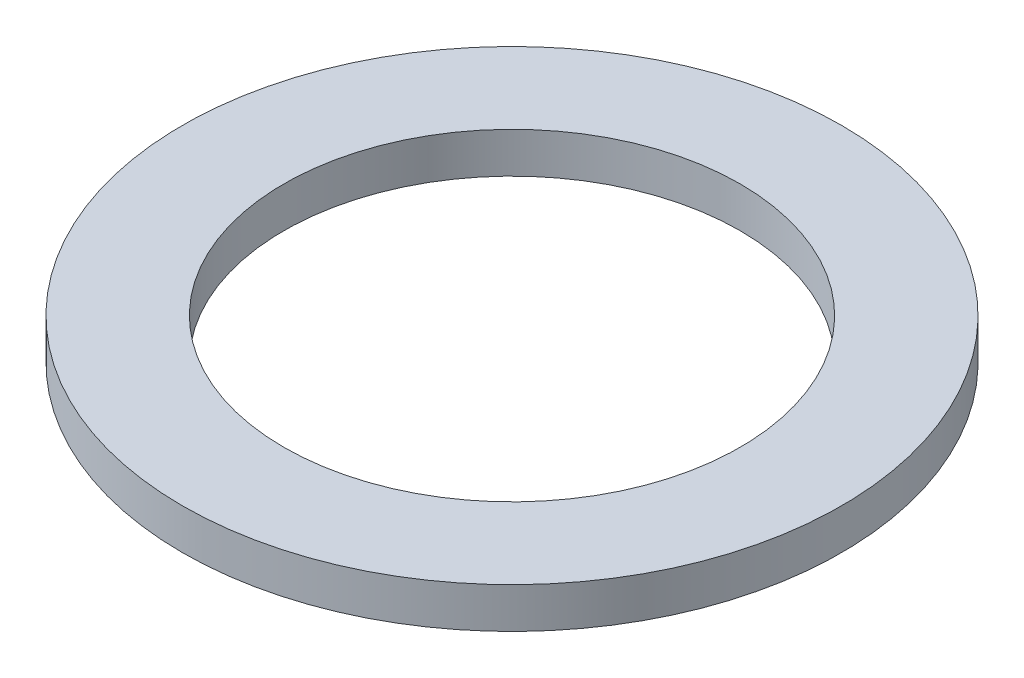
ISO-10303-21;
HEADER;
FILE_DESCRIPTION(('STEP AP214'),'2;1');
FILE_NAME('part.step','',(''),(''),'','','');
FILE_SCHEMA(('AUTOMOTIVE_DESIGN { 1 0 10303 214 1 1 1 1 }'));
ENDSEC;
DATA;
#1=APPLICATION_CONTEXT('core data for automotive mechanical design processes');
#2=APPLICATION_PROTOCOL_DEFINITION('international standard','automotive_design',2000,#1);
#3=PRODUCT_CONTEXT('',#1,'mechanical');
#4=PRODUCT('Part','Part','',(#3));
#5=PRODUCT_RELATED_PRODUCT_CATEGORY('part','',(#4));
#6=PRODUCT_DEFINITION_FORMATION('','',#4);
#7=PRODUCT_DEFINITION_CONTEXT('part definition',#1,'design');
#8=PRODUCT_DEFINITION('design','',#6,#7);
#9=PRODUCT_DEFINITION_SHAPE('','',#8);
#10=(LENGTH_UNIT() NAMED_UNIT(*) SI_UNIT(.MILLI.,.METRE.));
#11=(NAMED_UNIT(*) PLANE_ANGLE_UNIT() SI_UNIT($,.RADIAN.));
#12=(NAMED_UNIT(*) SI_UNIT($,.STERADIAN.) SOLID_ANGLE_UNIT());
#13=UNCERTAINTY_MEASURE_WITH_UNIT(LENGTH_MEASURE(1.E-05),#10,'distance_accuracy_value','');
#14=(GEOMETRIC_REPRESENTATION_CONTEXT(3) GLOBAL_UNCERTAINTY_ASSIGNED_CONTEXT((#13)) GLOBAL_UNIT_ASSIGNED_CONTEXT((#10,
#11,#12)) REPRESENTATION_CONTEXT('',''));
#15=CARTESIAN_POINT('',(0.,0.,0.));
#16=DIRECTION('',(0.,0.,1.));
#17=DIRECTION('',(1.,0.,0.));
#18=AXIS2_PLACEMENT_3D('',#15,#16,#17);
#19=CARTESIAN_POINT('',(0.,4.,0.));
#20=DIRECTION('',(0.,-1.,0.));
#21=DIRECTION('',(0.,0.,-1.));
#22=AXIS2_PLACEMENT_3D('',#19,#20,#21);
#23=CYLINDRICAL_SURFACE('',#22,32.5);
#24=CARTESIAN_POINT('',(0.,4.,0.));
#25=DIRECTION('',(0.,1.,0.));
#26=DIRECTION('',(0.,0.,1.));
#27=AXIS2_PLACEMENT_3D('',#24,#25,#26);
#28=CIRCLE('',#27,32.5);
#29=CARTESIAN_POINT('',(0.,4.,32.5));
#30=VERTEX_POINT('',#29);
#31=EDGE_CURVE('E10',#30,#30,#28,.T.);
#32=ORIENTED_EDGE('',*,*,#31,.F.);
#33=EDGE_LOOP('',(#32));
#34=FACE_BOUND('',#33,.T.);
#35=CARTESIAN_POINT('',(0.,0.,0.));
#36=DIRECTION('',(0.,1.,0.));
#37=DIRECTION('',(0.,0.,1.));
#38=AXIS2_PLACEMENT_3D('',#35,#36,#37);
#39=CIRCLE('',#38,32.5);
#40=CARTESIAN_POINT('',(0.,0.,32.5));
#41=VERTEX_POINT('',#40);
#42=EDGE_CURVE('E37',#41,#41,#39,.T.);
#43=ORIENTED_EDGE('',*,*,#42,.T.);
#44=EDGE_LOOP('',(#43));
#45=FACE_BOUND('',#44,.T.);
#46=ADVANCED_FACE('F40',(#34,#45),#23,.T.);
#47=CARTESIAN_POINT('',(0.,4.,0.));
#48=DIRECTION('',(0.,1.,0.));
#49=DIRECTION('',(0.,0.,1.));
#50=AXIS2_PLACEMENT_3D('',#47,#48,#49);
#51=PLANE('',#50);
#52=CARTESIAN_POINT('',(0.,4.,0.));
#53=DIRECTION('',(0.,1.,0.));
#54=DIRECTION('',(0.,0.,1.));
#55=AXIS2_PLACEMENT_3D('',#52,#53,#54);
#56=CIRCLE('',#55,22.5);
#57=CARTESIAN_POINT('',(0.,4.,22.5));
#58=VERTEX_POINT('',#57);
#59=EDGE_CURVE('E50',#58,#58,#56,.T.);
#60=ORIENTED_EDGE('',*,*,#59,.F.);
#61=EDGE_LOOP('',(#60));
#62=FACE_BOUND('',#61,.T.);
#63=ORIENTED_EDGE('',*,*,#31,.T.);
#64=EDGE_LOOP('',(#63));
#65=FACE_BOUND('',#64,.T.);
#66=ADVANCED_FACE('F59',(#62,#65),#51,.T.);
#67=CARTESIAN_POINT('',(0.,0.,0.));
#68=DIRECTION('',(0.,1.,0.));
#69=DIRECTION('',(0.,0.,1.));
#70=AXIS2_PLACEMENT_3D('',#67,#68,#69);
#71=PLANE('',#70);
#72=CARTESIAN_POINT('',(0.,0.,0.));
#73=DIRECTION('',(0.,1.,0.));
#74=DIRECTION('',(0.,0.,1.));
#75=AXIS2_PLACEMENT_3D('',#72,#73,#74);
#76=CIRCLE('',#75,22.5);
#77=CARTESIAN_POINT('',(0.,0.,22.5));
#78=VERTEX_POINT('',#77);
#79=EDGE_CURVE('E47',#78,#78,#76,.T.);
#80=ORIENTED_EDGE('',*,*,#79,.T.);
#81=EDGE_LOOP('',(#80));
#82=FACE_BOUND('',#81,.T.);
#83=ORIENTED_EDGE('',*,*,#42,.F.);
#84=EDGE_LOOP('',(#83));
#85=FACE_BOUND('',#84,.T.);
#86=ADVANCED_FACE('F58',(#82,#85),#71,.F.);
#87=CARTESIAN_POINT('',(0.,4.,0.));
#88=DIRECTION('',(0.,-1.,0.));
#89=DIRECTION('',(0.,0.,-1.));
#90=AXIS2_PLACEMENT_3D('',#87,#88,#89);
#91=CYLINDRICAL_SURFACE('',#90,22.5);
#92=ORIENTED_EDGE('',*,*,#59,.T.);
#93=EDGE_LOOP('',(#92));
#94=FACE_BOUND('',#93,.T.);
#95=ORIENTED_EDGE('',*,*,#79,.F.);
#96=EDGE_LOOP('',(#95));
#97=FACE_BOUND('',#96,.T.);
#98=ADVANCED_FACE('F54',(#94,#97),#91,.F.);
#99=CLOSED_SHELL('',(#46,#66,#86,#98));
#100=MANIFOLD_SOLID_BREP('B2',#99);
#101=ADVANCED_BREP_SHAPE_REPRESENTATION('',(#18,#100),#14);
#102=SHAPE_DEFINITION_REPRESENTATION(#9,#101);
ENDSEC;
END-ISO-10303-21;
